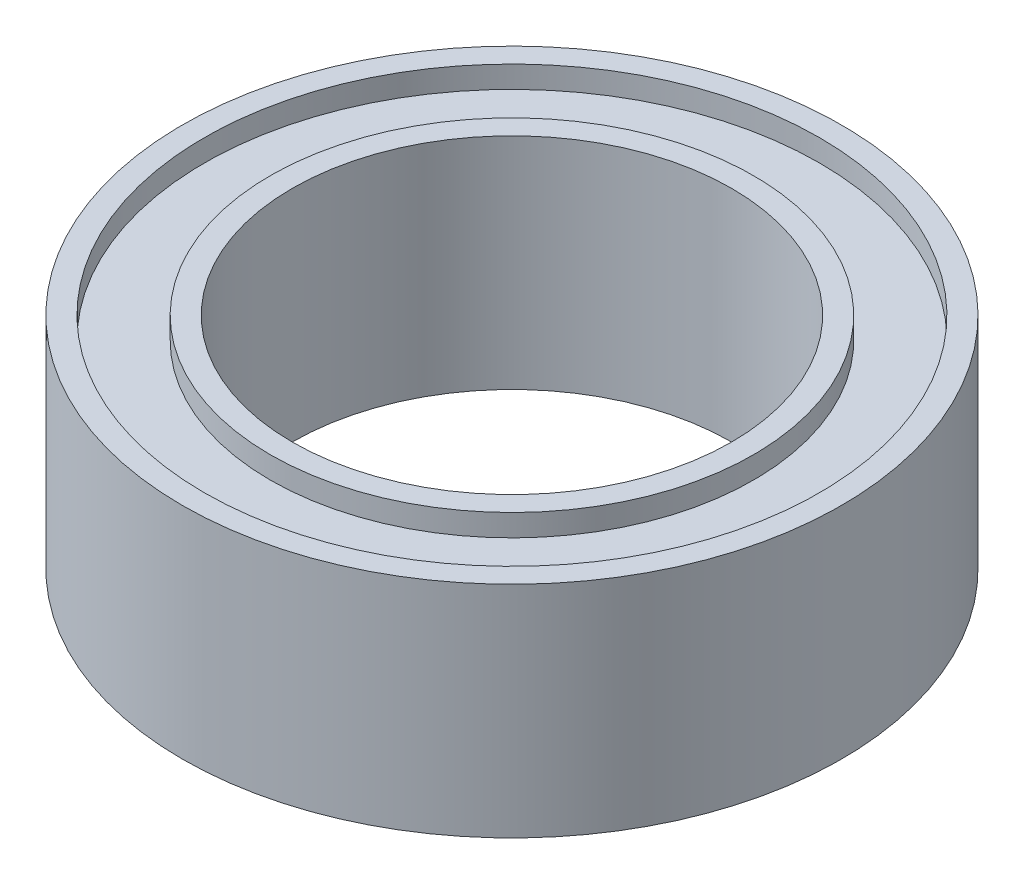
ISO-10303-21;
HEADER;
FILE_DESCRIPTION(('STEP AP214'),'2;1');
FILE_NAME('part.step','',(''),(''),'','','');
FILE_SCHEMA(('AUTOMOTIVE_DESIGN { 1 0 10303 214 1 1 1 1 }'));
ENDSEC;
DATA;
#1=APPLICATION_CONTEXT('core data for automotive mechanical design processes');
#2=APPLICATION_PROTOCOL_DEFINITION('international standard','automotive_design',2000,#1);
#3=PRODUCT_CONTEXT('',#1,'mechanical');
#4=PRODUCT('Part','Part','',(#3));
#5=PRODUCT_RELATED_PRODUCT_CATEGORY('part','',(#4));
#6=PRODUCT_DEFINITION_FORMATION('','',#4);
#7=PRODUCT_DEFINITION_CONTEXT('part definition',#1,'design');
#8=PRODUCT_DEFINITION('design','',#6,#7);
#9=PRODUCT_DEFINITION_SHAPE('','',#8);
#10=(LENGTH_UNIT() NAMED_UNIT(*) SI_UNIT(.MILLI.,.METRE.));
#11=(NAMED_UNIT(*) PLANE_ANGLE_UNIT() SI_UNIT($,.RADIAN.));
#12=(NAMED_UNIT(*) SI_UNIT($,.STERADIAN.) SOLID_ANGLE_UNIT());
#13=UNCERTAINTY_MEASURE_WITH_UNIT(LENGTH_MEASURE(1.E-05),#10,'distance_accuracy_value','');
#14=(GEOMETRIC_REPRESENTATION_CONTEXT(3) GLOBAL_UNCERTAINTY_ASSIGNED_CONTEXT((#13)) GLOBAL_UNIT_ASSIGNED_CONTEXT((#10,
#11,#12)) REPRESENTATION_CONTEXT('',''));
#15=CARTESIAN_POINT('',(0.,0.,0.));
#16=DIRECTION('',(0.,0.,1.));
#17=DIRECTION('',(1.,0.,0.));
#18=AXIS2_PLACEMENT_3D('',#15,#16,#17);
#19=CARTESIAN_POINT('',(0.,0.,0.));
#20=DIRECTION('',(0.,1.,0.));
#21=DIRECTION('',(0.,0.,1.));
#22=AXIS2_PLACEMENT_3D('',#19,#20,#21);
#23=PLANE('',#22);
#24=CARTESIAN_POINT('',(0.,0.,0.));
#25=DIRECTION('',(0.,1.,0.));
#26=DIRECTION('',(0.,0.,1.));
#27=AXIS2_PLACEMENT_3D('',#24,#25,#26);
#28=CIRCLE('',#27,5.);
#29=CARTESIAN_POINT('',(0.,0.,5.));
#30=VERTEX_POINT('',#29);
#31=EDGE_CURVE('E49',#30,#30,#28,.T.);
#32=ORIENTED_EDGE('',*,*,#31,.T.);
#33=EDGE_LOOP('',(#32));
#34=FACE_BOUND('',#33,.T.);
#35=CARTESIAN_POINT('',(0.,0.,0.));
#36=DIRECTION('',(0.,1.,0.));
#37=DIRECTION('',(0.,0.,1.));
#38=AXIS2_PLACEMENT_3D('',#35,#36,#37);
#39=CIRCLE('',#38,5.5);
#40=CARTESIAN_POINT('',(0.,0.,5.5));
#41=VERTEX_POINT('',#40);
#42=EDGE_CURVE('E73',#41,#41,#39,.T.);
#43=ORIENTED_EDGE('',*,*,#42,.F.);
#44=EDGE_LOOP('',(#43));
#45=FACE_BOUND('',#44,.T.);
#46=ADVANCED_FACE('F36',(#34,#45),#23,.F.);
#47=CARTESIAN_POINT('',(0.,5.,0.));
#48=DIRECTION('',(0.,1.,0.));
#49=DIRECTION('',(0.,0.,1.));
#50=AXIS2_PLACEMENT_3D('',#47,#48,#49);
#51=PLANE('',#50);
#52=CARTESIAN_POINT('',(0.,5.,0.));
#53=DIRECTION('',(0.,1.,0.));
#54=DIRECTION('',(0.,0.,1.));
#55=AXIS2_PLACEMENT_3D('',#52,#53,#54);
#56=CIRCLE('',#55,5.);
#57=CARTESIAN_POINT('',(0.,5.,5.));
#58=VERTEX_POINT('',#57);
#59=EDGE_CURVE('E47',#58,#58,#56,.T.);
#60=ORIENTED_EDGE('',*,*,#59,.F.);
#61=EDGE_LOOP('',(#60));
#62=FACE_BOUND('',#61,.T.);
#63=CARTESIAN_POINT('',(0.,5.,0.));
#64=DIRECTION('',(0.,1.,0.));
#65=DIRECTION('',(0.,0.,1.));
#66=AXIS2_PLACEMENT_3D('',#63,#64,#65);
#67=CIRCLE('',#66,5.5);
#68=CARTESIAN_POINT('',(0.,5.,5.5));
#69=VERTEX_POINT('',#68);
#70=EDGE_CURVE('E61',#69,#69,#67,.T.);
#71=ORIENTED_EDGE('',*,*,#70,.T.);
#72=EDGE_LOOP('',(#71));
#73=FACE_BOUND('',#72,.T.);
#74=ADVANCED_FACE('F89',(#62,#73),#51,.T.);
#75=CARTESIAN_POINT('',(0.,5.,0.));
#76=DIRECTION('',(0.,1.,0.));
#77=DIRECTION('',(0.,0.,1.));
#78=AXIS2_PLACEMENT_3D('',#75,#76,#77);
#79=CIRCLE('',#78,7.);
#80=CARTESIAN_POINT('',(0.,5.,7.));
#81=VERTEX_POINT('',#80);
#82=EDGE_CURVE('E55',#81,#81,#79,.T.);
#83=ORIENTED_EDGE('',*,*,#82,.F.);
#84=EDGE_LOOP('',(#83));
#85=FACE_BOUND('',#84,.T.);
#86=CARTESIAN_POINT('',(0.,5.,0.));
#87=DIRECTION('',(0.,1.,0.));
#88=DIRECTION('',(0.,0.,1.));
#89=AXIS2_PLACEMENT_3D('',#86,#87,#88);
#90=CIRCLE('',#89,7.5);
#91=CARTESIAN_POINT('',(0.,5.,7.5));
#92=VERTEX_POINT('',#91);
#93=EDGE_CURVE('E10',#92,#92,#90,.T.);
#94=ORIENTED_EDGE('',*,*,#93,.T.);
#95=EDGE_LOOP('',(#94));
#96=FACE_BOUND('',#95,.T.);
#97=ADVANCED_FACE('F95',(#85,#96),#51,.T.);
#98=CARTESIAN_POINT('',(0.,0.,0.));
#99=DIRECTION('',(0.,1.,0.));
#100=DIRECTION('',(0.,0.,1.));
#101=AXIS2_PLACEMENT_3D('',#98,#99,#100);
#102=CIRCLE('',#101,7.);
#103=CARTESIAN_POINT('',(0.,0.,7.));
#104=VERTEX_POINT('',#103);
#105=EDGE_CURVE('E67',#104,#104,#102,.T.);
#106=ORIENTED_EDGE('',*,*,#105,.T.);
#107=EDGE_LOOP('',(#106));
#108=FACE_BOUND('',#107,.T.);
#109=CARTESIAN_POINT('',(0.,0.,0.));
#110=DIRECTION('',(0.,1.,0.));
#111=DIRECTION('',(0.,0.,1.));
#112=AXIS2_PLACEMENT_3D('',#109,#110,#111);
#113=CIRCLE('',#112,7.5);
#114=CARTESIAN_POINT('',(0.,0.,7.5));
#115=VERTEX_POINT('',#114);
#116=EDGE_CURVE('E40',#115,#115,#113,.T.);
#117=ORIENTED_EDGE('',*,*,#116,.F.);
#118=EDGE_LOOP('',(#117));
#119=FACE_BOUND('',#118,.T.);
#120=ADVANCED_FACE('F91',(#108,#119),#23,.F.);
#121=CARTESIAN_POINT('',(0.,5.,0.));
#122=DIRECTION('',(0.,-1.,0.));
#123=DIRECTION('',(0.,0.,-1.));
#124=AXIS2_PLACEMENT_3D('',#121,#122,#123);
#125=CYLINDRICAL_SURFACE('',#124,7.5);
#126=ORIENTED_EDGE('',*,*,#93,.F.);
#127=EDGE_LOOP('',(#126));
#128=FACE_BOUND('',#127,.T.);
#129=ORIENTED_EDGE('',*,*,#116,.T.);
#130=EDGE_LOOP('',(#129));
#131=FACE_BOUND('',#130,.T.);
#132=ADVANCED_FACE('F38',(#128,#131),#125,.T.);
#133=CARTESIAN_POINT('',(0.,5.,0.));
#134=DIRECTION('',(0.,-1.,0.));
#135=DIRECTION('',(0.,0.,-1.));
#136=AXIS2_PLACEMENT_3D('',#133,#134,#135);
#137=CYLINDRICAL_SURFACE('',#136,5.);
#138=ORIENTED_EDGE('',*,*,#59,.T.);
#139=EDGE_LOOP('',(#138));
#140=FACE_BOUND('',#139,.T.);
#141=ORIENTED_EDGE('',*,*,#31,.F.);
#142=EDGE_LOOP('',(#141));
#143=FACE_BOUND('',#142,.T.);
#144=ADVANCED_FACE('F104',(#140,#143),#137,.F.);
#145=CARTESIAN_POINT('',(0.,4.5,0.));
#146=DIRECTION('',(0.,1.,0.));
#147=DIRECTION('',(0.,0.,1.));
#148=AXIS2_PLACEMENT_3D('',#145,#146,#147);
#149=CYLINDRICAL_SURFACE('',#148,7.);
#150=CARTESIAN_POINT('',(0.,4.5,0.));
#151=DIRECTION('',(0.,1.,0.));
#152=DIRECTION('',(0.,0.,1.));
#153=AXIS2_PLACEMENT_3D('',#150,#151,#152);
#154=CIRCLE('',#153,7.);
#155=CARTESIAN_POINT('',(0.,4.5,7.));
#156=VERTEX_POINT('',#155);
#157=EDGE_CURVE('E52',#156,#156,#154,.T.);
#158=ORIENTED_EDGE('',*,*,#157,.F.);
#159=EDGE_LOOP('',(#158));
#160=FACE_BOUND('',#159,.T.);
#161=ORIENTED_EDGE('',*,*,#82,.T.);
#162=EDGE_LOOP('',(#161));
#163=FACE_BOUND('',#162,.T.);
#164=ADVANCED_FACE('F128',(#160,#163),#149,.F.);
#165=CARTESIAN_POINT('',(0.,4.5,0.));
#166=DIRECTION('',(0.,1.,0.));
#167=DIRECTION('',(0.,0.,1.));
#168=AXIS2_PLACEMENT_3D('',#165,#166,#167);
#169=PLANE('',#168);
#170=CARTESIAN_POINT('',(0.,4.5,0.));
#171=DIRECTION('',(0.,1.,0.));
#172=DIRECTION('',(0.,0.,1.));
#173=AXIS2_PLACEMENT_3D('',#170,#171,#172);
#174=CIRCLE('',#173,5.5);
#175=CARTESIAN_POINT('',(0.,4.5,5.5));
#176=VERTEX_POINT('',#175);
#177=EDGE_CURVE('E58',#176,#176,#174,.T.);
#178=ORIENTED_EDGE('',*,*,#177,.F.);
#179=EDGE_LOOP('',(#178));
#180=FACE_BOUND('',#179,.T.);
#181=ORIENTED_EDGE('',*,*,#157,.T.);
#182=EDGE_LOOP('',(#181));
#183=FACE_BOUND('',#182,.T.);
#184=ADVANCED_FACE('F124',(#180,#183),#169,.T.);
#185=CARTESIAN_POINT('',(0.,4.5,0.));
#186=DIRECTION('',(0.,1.,0.));
#187=DIRECTION('',(0.,0.,1.));
#188=AXIS2_PLACEMENT_3D('',#185,#186,#187);
#189=CYLINDRICAL_SURFACE('',#188,5.5);
#190=ORIENTED_EDGE('',*,*,#177,.T.);
#191=EDGE_LOOP('',(#190));
#192=FACE_BOUND('',#191,.T.);
#193=ORIENTED_EDGE('',*,*,#70,.F.);
#194=EDGE_LOOP('',(#193));
#195=FACE_BOUND('',#194,.T.);
#196=ADVANCED_FACE('F118',(#192,#195),#189,.T.);
#197=CARTESIAN_POINT('',(0.,0.5,0.));
#198=DIRECTION('',(0.,-1.,0.));
#199=DIRECTION('',(0.,0.,1.));
#200=AXIS2_PLACEMENT_3D('',#197,#198,#199);
#201=PLANE('',#200);
#202=CARTESIAN_POINT('',(0.,0.5,0.));
#203=DIRECTION('',(0.,1.,0.));
#204=DIRECTION('',(0.,0.,1.));
#205=AXIS2_PLACEMENT_3D('',#202,#203,#204);
#206=CIRCLE('',#205,7.);
#207=CARTESIAN_POINT('',(0.,0.5,7.));
#208=VERTEX_POINT('',#207);
#209=EDGE_CURVE('E64',#208,#208,#206,.T.);
#210=ORIENTED_EDGE('',*,*,#209,.F.);
#211=EDGE_LOOP('',(#210));
#212=FACE_BOUND('',#211,.T.);
#213=CARTESIAN_POINT('',(0.,0.5,0.));
#214=DIRECTION('',(0.,1.,0.));
#215=DIRECTION('',(0.,0.,1.));
#216=AXIS2_PLACEMENT_3D('',#213,#214,#215);
#217=CIRCLE('',#216,5.5);
#218=CARTESIAN_POINT('',(0.,0.5,5.5));
#219=VERTEX_POINT('',#218);
#220=EDGE_CURVE('E70',#219,#219,#217,.T.);
#221=ORIENTED_EDGE('',*,*,#220,.T.);
#222=EDGE_LOOP('',(#221));
#223=FACE_BOUND('',#222,.T.);
#224=ADVANCED_FACE('F79',(#212,#223),#201,.T.);
#225=CARTESIAN_POINT('',(0.,0.5,0.));
#226=DIRECTION('',(0.,-1.,0.));
#227=DIRECTION('',(0.,0.,-1.));
#228=AXIS2_PLACEMENT_3D('',#225,#226,#227);
#229=CYLINDRICAL_SURFACE('',#228,7.);
#230=ORIENTED_EDGE('',*,*,#209,.T.);
#231=EDGE_LOOP('',(#230));
#232=FACE_BOUND('',#231,.T.);
#233=ORIENTED_EDGE('',*,*,#105,.F.);
#234=EDGE_LOOP('',(#233));
#235=FACE_BOUND('',#234,.T.);
#236=ADVANCED_FACE('F84',(#232,#235),#229,.F.);
#237=CARTESIAN_POINT('',(0.,0.5,0.));
#238=DIRECTION('',(0.,-1.,0.));
#239=DIRECTION('',(0.,0.,-1.));
#240=AXIS2_PLACEMENT_3D('',#237,#238,#239);
#241=CYLINDRICAL_SURFACE('',#240,5.5);
#242=ORIENTED_EDGE('',*,*,#220,.F.);
#243=EDGE_LOOP('',(#242));
#244=FACE_BOUND('',#243,.T.);
#245=ORIENTED_EDGE('',*,*,#42,.T.);
#246=EDGE_LOOP('',(#245));
#247=FACE_BOUND('',#246,.T.);
#248=ADVANCED_FACE('F81',(#244,#247),#241,.T.);
#249=CLOSED_SHELL('',(#46,#74,#97,#120,#132,#144,#164,#184,#196,#224,#236,#248));
#250=MANIFOLD_SOLID_BREP('B2',#249);
#251=ADVANCED_BREP_SHAPE_REPRESENTATION('',(#18,#250),#14);
#252=SHAPE_DEFINITION_REPRESENTATION(#9,#251);
ENDSEC;
END-ISO-10303-21;
